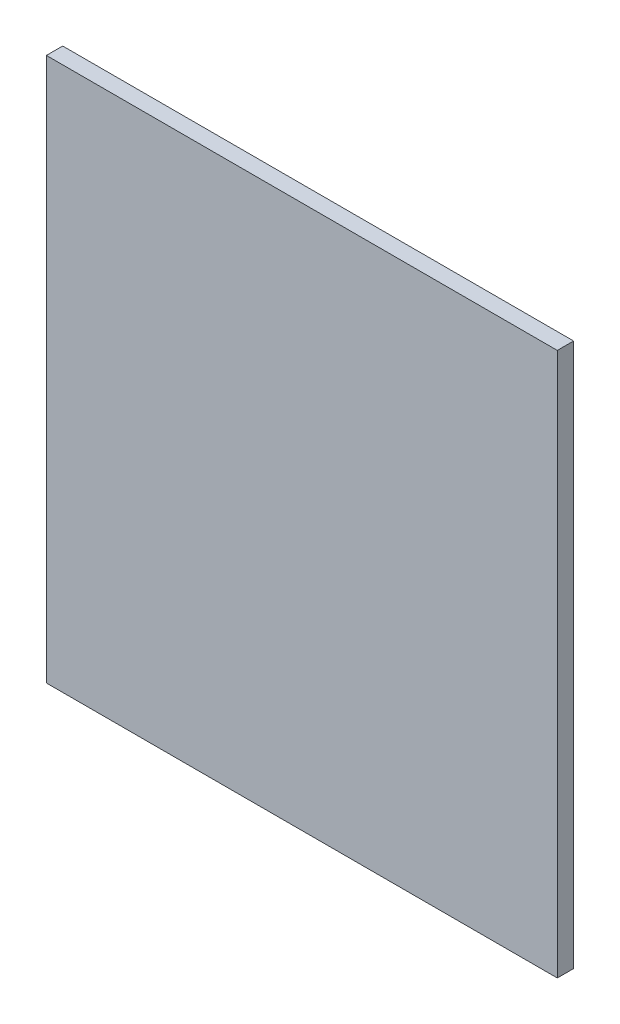
ISO-10303-21;
HEADER;
FILE_DESCRIPTION(('STEP AP214'),'2;1');
FILE_NAME('part.step','',(''),(''),'','','');
FILE_SCHEMA(('AUTOMOTIVE_DESIGN { 1 0 10303 214 1 1 1 1 }'));
ENDSEC;
DATA;
#1=APPLICATION_CONTEXT('core data for automotive mechanical design processes');
#2=APPLICATION_PROTOCOL_DEFINITION('international standard','automotive_design',2000,#1);
#3=PRODUCT_CONTEXT('',#1,'mechanical');
#4=PRODUCT('Part','Part','',(#3));
#5=PRODUCT_RELATED_PRODUCT_CATEGORY('part','',(#4));
#6=PRODUCT_DEFINITION_FORMATION('','',#4);
#7=PRODUCT_DEFINITION_CONTEXT('part definition',#1,'design');
#8=PRODUCT_DEFINITION('design','',#6,#7);
#9=PRODUCT_DEFINITION_SHAPE('','',#8);
#10=(LENGTH_UNIT() NAMED_UNIT(*) SI_UNIT(.MILLI.,.METRE.));
#11=(NAMED_UNIT(*) PLANE_ANGLE_UNIT() SI_UNIT($,.RADIAN.));
#12=(NAMED_UNIT(*) SI_UNIT($,.STERADIAN.) SOLID_ANGLE_UNIT());
#13=UNCERTAINTY_MEASURE_WITH_UNIT(LENGTH_MEASURE(1.E-05),#10,'distance_accuracy_value','');
#14=(GEOMETRIC_REPRESENTATION_CONTEXT(3) GLOBAL_UNCERTAINTY_ASSIGNED_CONTEXT((#13)) GLOBAL_UNIT_ASSIGNED_CONTEXT((#10,
#11,#12)) REPRESENTATION_CONTEXT('',''));
#15=CARTESIAN_POINT('',(0.,0.,0.));
#16=DIRECTION('',(0.,0.,1.));
#17=DIRECTION('',(1.,0.,0.));
#18=AXIS2_PLACEMENT_3D('',#15,#16,#17);
#19=CARTESIAN_POINT('',(282.,300.,18.));
#20=DIRECTION('',(-1.,0.,0.));
#21=DIRECTION('',(0.,-1.,0.));
#22=AXIS2_PLACEMENT_3D('',#19,#20,#21);
#23=PLANE('',#22);
#24=DIRECTION('',(0.,1.,0.));
#25=VECTOR('',#24,1.);
#26=CARTESIAN_POINT('',(282.,300.,0.));
#27=LINE('',#26,#25);
#28=CARTESIAN_POINT('',(282.,-300.,0.));
#29=VERTEX_POINT('',#28);
#30=CARTESIAN_POINT('',(282.,300.,0.));
#31=VERTEX_POINT('',#30);
#32=EDGE_CURVE('E100',#29,#31,#27,.T.);
#33=ORIENTED_EDGE('',*,*,#32,.T.);
#34=DIRECTION('',(0.,0.,-1.));
#35=VECTOR('',#34,1.);
#36=CARTESIAN_POINT('',(282.,300.,18.));
#37=LINE('',#36,#35);
#38=CARTESIAN_POINT('',(282.,300.,18.));
#39=VERTEX_POINT('',#38);
#40=EDGE_CURVE('E11',#39,#31,#37,.T.);
#41=ORIENTED_EDGE('',*,*,#40,.F.);
#42=DIRECTION('',(0.,1.,0.));
#43=VECTOR('',#42,1.);
#44=CARTESIAN_POINT('',(282.,300.,18.));
#45=LINE('',#44,#43);
#46=CARTESIAN_POINT('',(282.,-300.,18.));
#47=VERTEX_POINT('',#46);
#48=EDGE_CURVE('E88',#47,#39,#45,.T.);
#49=ORIENTED_EDGE('',*,*,#48,.F.);
#50=DIRECTION('',(0.,0.,-1.));
#51=VECTOR('',#50,1.);
#52=CARTESIAN_POINT('',(282.,-300.,18.));
#53=LINE('',#52,#51);
#54=EDGE_CURVE('E96',#47,#29,#53,.T.);
#55=ORIENTED_EDGE('',*,*,#54,.T.);
#56=EDGE_LOOP('',(#33,#41,#49,#55));
#57=FACE_BOUND('',#56,.T.);
#58=ADVANCED_FACE('F37',(#57),#23,.F.);
#59=CARTESIAN_POINT('',(-282.,300.,18.));
#60=DIRECTION('',(0.,-1.,0.));
#61=DIRECTION('',(0.,0.,-1.));
#62=AXIS2_PLACEMENT_3D('',#59,#60,#61);
#63=PLANE('',#62);
#64=DIRECTION('',(-1.,0.,0.));
#65=VECTOR('',#64,1.);
#66=CARTESIAN_POINT('',(-282.,300.,0.));
#67=LINE('',#66,#65);
#68=CARTESIAN_POINT('',(-282.,300.,0.));
#69=VERTEX_POINT('',#68);
#70=EDGE_CURVE('E92',#31,#69,#67,.T.);
#71=ORIENTED_EDGE('',*,*,#70,.T.);
#72=DIRECTION('',(0.,0.,-1.));
#73=VECTOR('',#72,1.);
#74=CARTESIAN_POINT('',(-282.,300.,18.));
#75=LINE('',#74,#73);
#76=CARTESIAN_POINT('',(-282.,300.,18.));
#77=VERTEX_POINT('',#76);
#78=EDGE_CURVE('E45',#77,#69,#75,.T.);
#79=ORIENTED_EDGE('',*,*,#78,.F.);
#80=DIRECTION('',(-1.,0.,0.));
#81=VECTOR('',#80,1.);
#82=CARTESIAN_POINT('',(-282.,300.,18.));
#83=LINE('',#82,#81);
#84=EDGE_CURVE('E83',#39,#77,#83,.T.);
#85=ORIENTED_EDGE('',*,*,#84,.F.);
#86=ORIENTED_EDGE('',*,*,#40,.T.);
#87=EDGE_LOOP('',(#71,#79,#85,#86));
#88=FACE_BOUND('',#87,.T.);
#89=ADVANCED_FACE('F91',(#88),#63,.F.);
#90=CARTESIAN_POINT('',(-282.,300.,18.));
#91=DIRECTION('',(1.,0.,0.));
#92=DIRECTION('',(0.,1.,0.));
#93=AXIS2_PLACEMENT_3D('',#90,#91,#92);
#94=PLANE('',#93);
#95=DIRECTION('',(0.,-1.,0.));
#96=VECTOR('',#95,1.);
#97=CARTESIAN_POINT('',(-282.,300.,0.));
#98=LINE('',#97,#96);
#99=CARTESIAN_POINT('',(-282.,-300.,0.));
#100=VERTEX_POINT('',#99);
#101=EDGE_CURVE('E70',#69,#100,#98,.T.);
#102=ORIENTED_EDGE('',*,*,#101,.T.);
#103=DIRECTION('',(0.,0.,-1.));
#104=VECTOR('',#103,1.);
#105=CARTESIAN_POINT('',(-282.,-300.,18.));
#106=LINE('',#105,#104);
#107=CARTESIAN_POINT('',(-282.,-300.,18.));
#108=VERTEX_POINT('',#107);
#109=EDGE_CURVE('E93',#108,#100,#106,.T.);
#110=ORIENTED_EDGE('',*,*,#109,.F.);
#111=DIRECTION('',(0.,-1.,0.));
#112=VECTOR('',#111,1.);
#113=CARTESIAN_POINT('',(-282.,300.,18.));
#114=LINE('',#113,#112);
#115=EDGE_CURVE('E86',#77,#108,#114,.T.);
#116=ORIENTED_EDGE('',*,*,#115,.F.);
#117=ORIENTED_EDGE('',*,*,#78,.T.);
#118=EDGE_LOOP('',(#102,#110,#116,#117));
#119=FACE_BOUND('',#118,.T.);
#120=ADVANCED_FACE('F94',(#119),#94,.F.);
#121=CARTESIAN_POINT('',(-282.,-300.,18.));
#122=DIRECTION('',(0.,1.,0.));
#123=DIRECTION('',(0.,0.,1.));
#124=AXIS2_PLACEMENT_3D('',#121,#122,#123);
#125=PLANE('',#124);
#126=DIRECTION('',(1.,0.,0.));
#127=VECTOR('',#126,1.);
#128=CARTESIAN_POINT('',(-282.,-300.,0.));
#129=LINE('',#128,#127);
#130=EDGE_CURVE('E76',#100,#29,#129,.T.);
#131=ORIENTED_EDGE('',*,*,#130,.T.);
#132=ORIENTED_EDGE('',*,*,#54,.F.);
#133=DIRECTION('',(1.,0.,0.));
#134=VECTOR('',#133,1.);
#135=CARTESIAN_POINT('',(-282.,-300.,18.));
#136=LINE('',#135,#134);
#137=EDGE_CURVE('E53',#108,#47,#136,.T.);
#138=ORIENTED_EDGE('',*,*,#137,.F.);
#139=ORIENTED_EDGE('',*,*,#109,.T.);
#140=EDGE_LOOP('',(#131,#132,#138,#139));
#141=FACE_BOUND('',#140,.T.);
#142=ADVANCED_FACE('F107',(#141),#125,.F.);
#143=CARTESIAN_POINT('',(0.,0.,18.));
#144=DIRECTION('',(0.,0.,1.));
#145=DIRECTION('',(1.,0.,0.));
#146=AXIS2_PLACEMENT_3D('',#143,#144,#145);
#147=PLANE('',#146);
#148=ORIENTED_EDGE('',*,*,#48,.T.);
#149=ORIENTED_EDGE('',*,*,#84,.T.);
#150=ORIENTED_EDGE('',*,*,#115,.T.);
#151=ORIENTED_EDGE('',*,*,#137,.T.);
#152=EDGE_LOOP('',(#148,#149,#150,#151));
#153=FACE_BOUND('',#152,.T.);
#154=ADVANCED_FACE('F84',(#153),#147,.T.);
#155=CARTESIAN_POINT('',(0.,0.,0.));
#156=DIRECTION('',(0.,0.,1.));
#157=DIRECTION('',(1.,0.,0.));
#158=AXIS2_PLACEMENT_3D('',#155,#156,#157);
#159=PLANE('',#158);
#160=ORIENTED_EDGE('',*,*,#32,.F.);
#161=ORIENTED_EDGE('',*,*,#130,.F.);
#162=ORIENTED_EDGE('',*,*,#101,.F.);
#163=ORIENTED_EDGE('',*,*,#70,.F.);
#164=EDGE_LOOP('',(#160,#161,#162,#163));
#165=FACE_BOUND('',#164,.T.);
#166=ADVANCED_FACE('F110',(#165),#159,.F.);
#167=CLOSED_SHELL('',(#58,#89,#120,#142,#154,#166));
#168=MANIFOLD_SOLID_BREP('B2',#167);
#169=ADVANCED_BREP_SHAPE_REPRESENTATION('',(#18,#168),#14);
#170=SHAPE_DEFINITION_REPRESENTATION(#9,#169);
ENDSEC;
END-ISO-10303-21;
